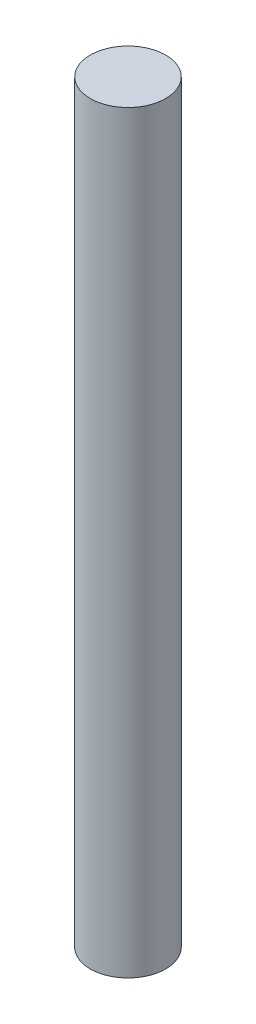
ISO-10303-21;
HEADER;
FILE_DESCRIPTION(('STEP AP214'),'2;1');
FILE_NAME('part.step','',(''),(''),'','','');
FILE_SCHEMA(('AUTOMOTIVE_DESIGN { 1 0 10303 214 1 1 1 1 }'));
ENDSEC;
DATA;
#1=APPLICATION_CONTEXT('core data for automotive mechanical design processes');
#2=APPLICATION_PROTOCOL_DEFINITION('international standard','automotive_design',2000,#1);
#3=PRODUCT_CONTEXT('',#1,'mechanical');
#4=PRODUCT('Part','Part','',(#3));
#5=PRODUCT_RELATED_PRODUCT_CATEGORY('part','',(#4));
#6=PRODUCT_DEFINITION_FORMATION('','',#4);
#7=PRODUCT_DEFINITION_CONTEXT('part definition',#1,'design');
#8=PRODUCT_DEFINITION('design','',#6,#7);
#9=PRODUCT_DEFINITION_SHAPE('','',#8);
#10=(LENGTH_UNIT() NAMED_UNIT(*) SI_UNIT(.MILLI.,.METRE.));
#11=(NAMED_UNIT(*) PLANE_ANGLE_UNIT() SI_UNIT($,.RADIAN.));
#12=(NAMED_UNIT(*) SI_UNIT($,.STERADIAN.) SOLID_ANGLE_UNIT());
#13=UNCERTAINTY_MEASURE_WITH_UNIT(LENGTH_MEASURE(1.E-05),#10,'distance_accuracy_value','');
#14=(GEOMETRIC_REPRESENTATION_CONTEXT(3) GLOBAL_UNCERTAINTY_ASSIGNED_CONTEXT((#13)) GLOBAL_UNIT_ASSIGNED_CONTEXT((#10,
#11,#12)) REPRESENTATION_CONTEXT('',''));
#15=CARTESIAN_POINT('',(0.,0.,0.));
#16=DIRECTION('',(0.,0.,1.));
#17=DIRECTION('',(1.,0.,0.));
#18=AXIS2_PLACEMENT_3D('',#15,#16,#17);
#19=CARTESIAN_POINT('',(0.,500.,0.));
#20=DIRECTION('',(0.,-1.,0.));
#21=DIRECTION('',(0.,0.,-1.));
#22=AXIS2_PLACEMENT_3D('',#19,#20,#21);
#23=CYLINDRICAL_SURFACE('',#22,25.);
#24=CARTESIAN_POINT('',(0.,500.,0.));
#25=DIRECTION('',(0.,1.,0.));
#26=DIRECTION('',(0.,0.,1.));
#27=AXIS2_PLACEMENT_3D('',#24,#25,#26);
#28=CIRCLE('',#27,25.);
#29=CARTESIAN_POINT('',(0.,500.,25.));
#30=VERTEX_POINT('',#29);
#31=EDGE_CURVE('E10',#30,#30,#28,.T.);
#32=ORIENTED_EDGE('',*,*,#31,.F.);
#33=EDGE_LOOP('',(#32));
#34=FACE_BOUND('',#33,.T.);
#35=CARTESIAN_POINT('',(0.,0.,0.));
#36=DIRECTION('',(0.,1.,0.));
#37=DIRECTION('',(0.,0.,1.));
#38=AXIS2_PLACEMENT_3D('',#35,#36,#37);
#39=CIRCLE('',#38,25.);
#40=CARTESIAN_POINT('',(0.,0.,25.));
#41=VERTEX_POINT('',#40);
#42=EDGE_CURVE('E40',#41,#41,#39,.T.);
#43=ORIENTED_EDGE('',*,*,#42,.T.);
#44=EDGE_LOOP('',(#43));
#45=FACE_BOUND('',#44,.T.);
#46=ADVANCED_FACE('F37',(#34,#45),#23,.T.);
#47=CARTESIAN_POINT('',(0.,500.,0.));
#48=DIRECTION('',(0.,1.,0.));
#49=DIRECTION('',(0.,0.,1.));
#50=AXIS2_PLACEMENT_3D('',#47,#48,#49);
#51=PLANE('',#50);
#52=ORIENTED_EDGE('',*,*,#31,.T.);
#53=EDGE_LOOP('',(#52));
#54=FACE_BOUND('',#53,.T.);
#55=ADVANCED_FACE('F54',(#54),#51,.T.);
#56=CARTESIAN_POINT('',(0.,0.,0.));
#57=DIRECTION('',(0.,1.,0.));
#58=DIRECTION('',(0.,0.,1.));
#59=AXIS2_PLACEMENT_3D('',#56,#57,#58);
#60=PLANE('',#59);
#61=ORIENTED_EDGE('',*,*,#42,.F.);
#62=EDGE_LOOP('',(#61));
#63=FACE_BOUND('',#62,.T.);
#64=ADVANCED_FACE('F52',(#63),#60,.F.);
#65=CLOSED_SHELL('',(#46,#55,#64));
#66=MANIFOLD_SOLID_BREP('B2',#65);
#67=ADVANCED_BREP_SHAPE_REPRESENTATION('',(#18,#66),#14);
#68=SHAPE_DEFINITION_REPRESENTATION(#9,#67);
ENDSEC;
END-ISO-10303-21;
